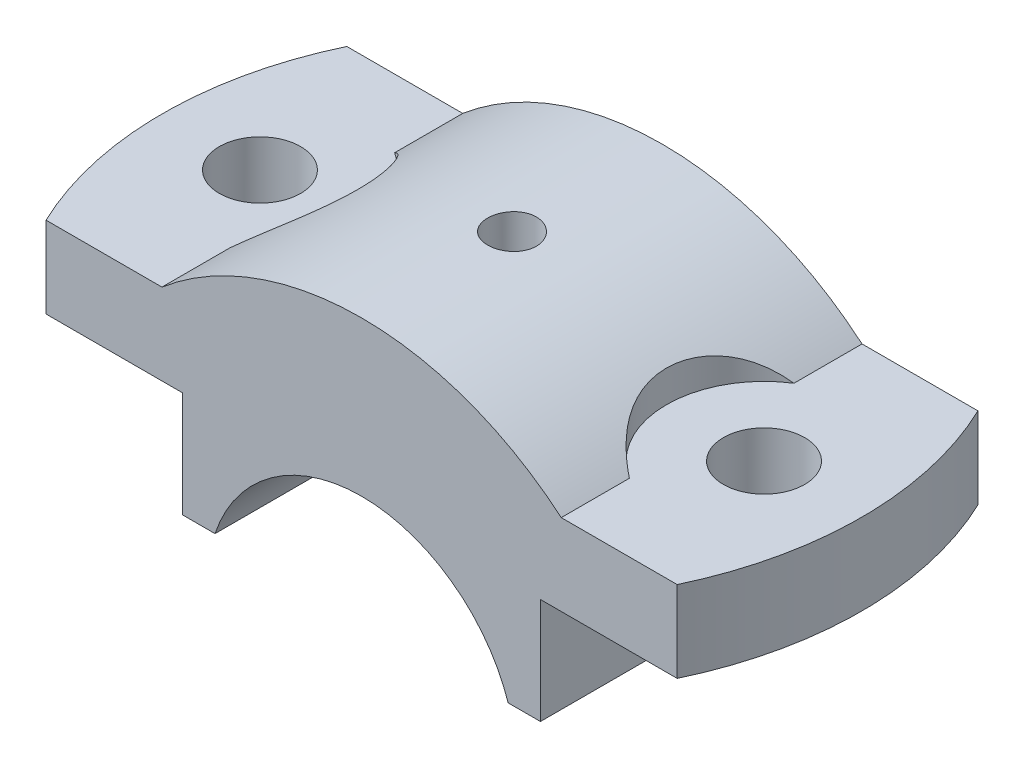
ISO-10303-21;
HEADER;
FILE_DESCRIPTION(('STEP AP214'),'2;1');
FILE_NAME('part.step','',(''),(''),'','','');
FILE_SCHEMA(('AUTOMOTIVE_DESIGN { 1 0 10303 214 1 1 1 1 }'));
ENDSEC;
DATA;
#1=APPLICATION_CONTEXT('core data for automotive mechanical design processes');
#2=APPLICATION_PROTOCOL_DEFINITION('international standard','automotive_design',2000,#1);
#3=PRODUCT_CONTEXT('',#1,'mechanical');
#4=PRODUCT('Part','Part','',(#3));
#5=PRODUCT_RELATED_PRODUCT_CATEGORY('part','',(#4));
#6=PRODUCT_DEFINITION_FORMATION('','',#4);
#7=PRODUCT_DEFINITION_CONTEXT('part definition',#1,'design');
#8=PRODUCT_DEFINITION('design','',#6,#7);
#9=PRODUCT_DEFINITION_SHAPE('','',#8);
#10=(LENGTH_UNIT() NAMED_UNIT(*) SI_UNIT(.MILLI.,.METRE.));
#11=(NAMED_UNIT(*) PLANE_ANGLE_UNIT() SI_UNIT($,.RADIAN.));
#12=(NAMED_UNIT(*) SI_UNIT($,.STERADIAN.) SOLID_ANGLE_UNIT());
#13=UNCERTAINTY_MEASURE_WITH_UNIT(LENGTH_MEASURE(1.E-05),#10,'distance_accuracy_value','');
#14=(GEOMETRIC_REPRESENTATION_CONTEXT(3) GLOBAL_UNCERTAINTY_ASSIGNED_CONTEXT((#13)) GLOBAL_UNIT_ASSIGNED_CONTEXT((#10,
#11,#12)) REPRESENTATION_CONTEXT('',''));
#15=CARTESIAN_POINT('',(0.,0.,0.));
#16=DIRECTION('',(0.,0.,1.));
#17=DIRECTION('',(1.,0.,0.));
#18=AXIS2_PLACEMENT_3D('',#15,#16,#17);
#19=CARTESIAN_POINT('',(0.,0.,18.5));
#20=DIRECTION('',(0.,0.,-1.));
#21=DIRECTION('',(-1.,0.,0.));
#22=AXIS2_PLACEMENT_3D('',#19,#20,#21);
#23=CYLINDRICAL_SURFACE('',#22,38.);
#24=CARTESIAN_POINT('',(0.,38.,3.));
#25=CARTESIAN_POINT('',(-0.168230277437707,37.9999984430739,2.99999263868346));
#26=CARTESIAN_POINT('',(-0.336575845655096,37.9988709200709,2.98580169916932));
#27=CARTESIAN_POINT('',(-0.668611397196743,37.9944814128081,2.92939894930334));
#28=CARTESIAN_POINT('',(-0.83229585009201,37.9912169949171,2.88715518982944));
#29=CARTESIAN_POINT('',(-1.15015205512758,37.9829226863334,2.77587406357067));
#30=CARTESIAN_POINT('',(-1.30432904935511,37.9778937789402,2.70685161752221));
#31=CARTESIAN_POINT('',(-1.59887136159142,37.9666348413683,2.54399853963547));
#32=CARTESIAN_POINT('',(-1.73923967362019,37.9604050724332,2.45017330191646));
#33=CARTESIAN_POINT('',(-2.00254103126273,37.9474277075509,2.24014409327319));
#34=CARTESIAN_POINT('',(-2.12543792166293,37.9406790810774,2.1238948563935));
#35=CARTESIAN_POINT('',(-2.3499978098834,37.9274332919605,1.87241281605956));
#36=CARTESIAN_POINT('',(-2.45165988585508,37.9209361402441,1.73717918887838));
#37=CARTESIAN_POINT('',(-2.63098484586303,37.9089176287414,1.45135065682847));
#38=CARTESIAN_POINT('',(-2.70861625469701,37.903397552738,1.30073594623714));
#39=CARTESIAN_POINT('',(-2.83747510230932,37.8939696224707,0.988558849059875));
#40=CARTESIAN_POINT('',(-2.8887029645124,37.8900617423529,0.82699663808231));
#41=CARTESIAN_POINT('',(-2.96319644645853,37.8843090780475,0.497870679819641));
#42=CARTESIAN_POINT('',(-2.98652059882487,37.8824599758018,0.330320257357769));
#43=CARTESIAN_POINT('',(-3.00472536931326,37.8810204867557,-0.00632681714998152));
#44=CARTESIAN_POINT('',(-2.99960647157769,37.8814300615093,-0.175423442828304));
#45=CARTESIAN_POINT('',(-2.96111886260012,37.8844577346025,-0.509962310035284));
#46=CARTESIAN_POINT('',(-2.92781369865024,37.8870708648728,-0.675411913710738));
#47=CARTESIAN_POINT('',(-2.83399765916123,37.8942034046858,-0.998365215123266));
#48=CARTESIAN_POINT('',(-2.77348654183749,37.8987228311701,-1.15586884222906));
#49=CARTESIAN_POINT('',(-2.62690490032728,37.9091644380148,-1.45866214971911));
#50=CARTESIAN_POINT('',(-2.5408057912968,37.9150881856644,-1.60393793599879));
#51=CARTESIAN_POINT('',(-2.34551283184453,37.9276694800349,-1.87799978791044));
#52=CARTESIAN_POINT('',(-2.23631856235737,37.9343270400699,-2.0067855542603));
#53=CARTESIAN_POINT('',(-1.99757813910437,37.947647885739,-2.24458115896057));
#54=CARTESIAN_POINT('',(-1.86797703439473,37.9543111370687,-2.35353583758634));
#55=CARTESIAN_POINT('',(-1.59229376436977,37.9668751419437,-2.54815019879117));
#56=CARTESIAN_POINT('',(-1.44621158946689,37.9727758950454,-2.63380986781872));
#57=CARTESIAN_POINT('',(-1.14167761997914,37.983150993084,-2.77939892547026));
#58=CARTESIAN_POINT('',(-0.98322469233549,37.9876252071703,-2.83932595392176));
#59=CARTESIAN_POINT('',(-0.658463212690179,37.9946415451888,-2.93171041942903));
#60=CARTESIAN_POINT('',(-0.492154807064348,37.997183705107,-2.96416836811963));
#61=CARTESIAN_POINT('',(-0.156881478742686,38.0000448768352,-3.00062434440681));
#62=CARTESIAN_POINT('',(0.0120751089608367,38.0003698415183,-3.00469857910483));
#63=CARTESIAN_POINT('',(0.348269003373998,37.9987758913175,-2.98447098943403));
#64=CARTESIAN_POINT('',(0.515506324442483,37.9968569951891,-2.96016940224689));
#65=CARTESIAN_POINT('',(0.843297753735754,37.9909950041868,-2.88394314979588));
#66=CARTESIAN_POINT('',(1.00386010671882,37.987054491835,-2.83205372367032));
#67=CARTESIAN_POINT('',(1.31399900365979,37.9775920824189,-2.70216068710783));
#68=CARTESIAN_POINT('',(1.46357539119334,37.972070162843,-2.62415670492505));
#69=CARTESIAN_POINT('',(1.74784375041781,37.9600494395666,-2.4440567104013));
#70=CARTESIAN_POINT('',(1.88250358772923,37.953548595394,-2.34191011569746));
#71=CARTESIAN_POINT('',(2.13279217984117,37.9403075453845,-2.1164976605111));
#72=CARTESIAN_POINT('',(2.24842063776819,37.9335673358158,-1.99323147064188));
#73=CARTESIAN_POINT('',(2.45762484975141,37.9205896766453,-1.72874864835166));
#74=CARTESIAN_POINT('',(2.55115094155128,37.9143533795852,-1.5874926690468));
#75=CARTESIAN_POINT('',(2.71315523827201,37.9031055627809,-1.29123629441747));
#76=CARTESIAN_POINT('',(2.78163367119924,37.8980940318878,-1.13623602422189));
#77=CARTESIAN_POINT('',(2.89151387110069,37.8898693720601,-0.817068099787169));
#78=CARTESIAN_POINT('',(2.93294623887225,37.8866542112497,-0.652911034998947));
#79=CARTESIAN_POINT('',(2.98765790023767,37.8823793491511,-0.319943850373173));
#80=CARTESIAN_POINT('',(3.00093767292138,37.8813196111828,-0.151133809767669));
#81=CARTESIAN_POINT('',(2.99896188688676,37.8814760426207,0.185853858942923));
#82=CARTESIAN_POINT('',(2.98378436644712,37.8826859878913,0.3540319530016));
#83=CARTESIAN_POINT('',(2.92548733876923,37.887232237977,0.685442873019112));
#84=CARTESIAN_POINT('',(2.8823677867555,37.8905685461995,0.84867569105299));
#85=CARTESIAN_POINT('',(2.76943001015431,37.8989899804525,1.16556899687011));
#86=CARTESIAN_POINT('',(2.69961296444522,37.9040750292632,1.31922990697071));
#87=CARTESIAN_POINT('',(2.535271096382,37.9154210711218,1.61266178094887));
#88=CARTESIAN_POINT('',(2.44074672054795,37.9216820429175,1.75243299578316));
#89=CARTESIAN_POINT('',(2.2293806238227,37.9346948182221,2.014516802884));
#90=CARTESIAN_POINT('',(2.11248130954252,37.941447859921,2.13678288515433));
#91=CARTESIAN_POINT('',(1.85978424897896,37.954672635902,2.36000556130417));
#92=CARTESIAN_POINT('',(1.72398192526551,37.9611443015481,2.46095697881558));
#93=CARTESIAN_POINT('',(1.43709756450133,37.9730876131211,2.63880542567551));
#94=CARTESIAN_POINT('',(1.2859897583193,37.978557527474,2.71566096437294));
#95=CARTESIAN_POINT('',(0.973076064569828,37.9878601967286,2.84281200189951));
#96=CARTESIAN_POINT('',(0.811282773093929,37.9916948408735,2.89313816633252));
#97=CARTESIAN_POINT('',(0.540438770546246,37.9963056825779,2.95292296572034));
#98=CARTESIAN_POINT('',(0.43313209821729,37.9976847801056,2.97055353917028));
#99=CARTESIAN_POINT('',(0.217232975456251,37.9995324404705,2.99409441950641));
#100=CARTESIAN_POINT('',(0.108640528034263,38.0000010054389,3.0000047538251));
#101=CARTESIAN_POINT('',(0.,38.,3.));
#102=B_SPLINE_CURVE_WITH_KNOTS('',3,(#24,#25,#26,#27,#28,#29,#30,#31,#32,#33,#34,#35,#36,#37,
#38,#39,#40,#41,#42,#43,#44,#45,#46,#47,#48,#49,#50,#51,#52,#53,#54,#55,#56,#57,#58,#59,#60,#61,
#62,#63,#64,#65,#66,#67,#68,#69,#70,#71,#72,#73,#74,#75,#76,#77,#78,#79,#80,#81,#82,#83,#84,#85,
#86,#87,#88,#89,#90,#91,#92,#93,#94,#95,#96,#97,#98,#99,#100,#101),.UNSPECIFIED.,.T.,.F.,(4,2,2,
2,2,2,2,2,2,2,2,2,2,2,2,2,2,2,2,2,2,2,2,2,2,2,2,2,2,2,2,2,2,2,2,2,2,2,4),(0.,0.504294188546742,
1.00916370078727,1.51375230936014,2.01823126998903,2.5237394549149,3.0292695804704,
3.53545907123703,4.04164044416133,4.54675814609822,5.05186725021796,5.55584058602809,
6.05981840083594,6.56436134901273,7.06891345298729,7.57484819748389,8.08078323629981,
8.5867646690735,9.09273667730813,9.59734968185782,10.1019584685879,10.6059242398503,
11.1098971854695,11.614935538604,12.1199817691652,12.6261522324058,13.1323180879118,
13.6379102536977,14.1434938154447,14.6476929456065,15.1518928837201,15.6560705605014,
16.1602391262259,16.6657233184336,17.1713301290485,17.6778028214878,18.183688785524,
18.5093549854357,18.8350204230892),.UNSPECIFIED.);
#103=CARTESIAN_POINT('',(0.,38.,3.));
#104=VERTEX_POINT('',#103);
#105=EDGE_CURVE('E12',#104,#104,#102,.T.);
#106=ORIENTED_EDGE('',*,*,#105,.T.);
#107=EDGE_LOOP('',(#106));
#108=FACE_BOUND('',#107,.T.);
#109=CARTESIAN_POINT('',(-24.5560583156174,29.,10.1230240327817));
#110=CARTESIAN_POINT('',(-24.3174877485478,29.2020601308055,9.97119467321229));
#111=CARTESIAN_POINT('',(-24.0803614609093,29.3977464472566,9.80836197663199));
#112=CARTESIAN_POINT('',(-23.6115222338329,29.7755940747945,9.46020848333533));
#113=CARTESIAN_POINT('',(-23.3798137585639,29.9577444842871,9.27486987046865));
#114=CARTESIAN_POINT('',(-22.9236672054079,30.3082297817881,8.8805505950972));
#115=CARTESIAN_POINT('',(-22.6992678834907,30.4764965902736,8.67146414758177));
#116=CARTESIAN_POINT('',(-22.2619530588752,30.7973853777589,8.23060697580725));
#117=CARTESIAN_POINT('',(-22.0490345989108,30.9500113947584,7.99884213681137));
#118=CARTESIAN_POINT('',(-21.6366389073685,31.2397139014292,7.51197498371822));
#119=CARTESIAN_POINT('',(-21.4372383074072,31.3767043342369,7.25675627382115));
#120=CARTESIAN_POINT('',(-21.0562467019345,31.633641893745,6.72522759534227));
#121=CARTESIAN_POINT('',(-20.8746574661728,31.7535873273726,6.44891553575109));
#122=CARTESIAN_POINT('',(-20.5327564022873,31.9757314891997,5.87769783144448));
#123=CARTESIAN_POINT('',(-20.3723929409772,32.0779734764171,5.58283998067528));
#124=CARTESIAN_POINT('',(-20.0751813729038,32.2648095853997,4.97618208833444));
#125=CARTESIAN_POINT('',(-19.938330146147,32.349406048985,4.66438430187312));
#126=CARTESIAN_POINT('',(-19.7031571958431,32.4931162623317,4.0590392734102));
#127=CARTESIAN_POINT('',(-19.6023304372824,32.5539481974974,3.76686941254452));
#128=CARTESIAN_POINT('',(-19.4229982355688,32.661262620038,3.17319380129246));
#129=CARTESIAN_POINT('',(-19.3444914281107,32.707745984483,2.87168862277639));
#130=CARTESIAN_POINT('',(-19.2108996671468,32.7863897663112,2.26156700473532));
#131=CARTESIAN_POINT('',(-19.1558244632389,32.8185442218776,1.95294766128773));
#132=CARTESIAN_POINT('',(-19.0699386598041,32.8685247770595,1.33120533745258));
#133=CARTESIAN_POINT('',(-19.0391272676089,32.8863513447496,1.01808250452872));
#134=CARTESIAN_POINT('',(-19.0033366089455,32.9070445700549,0.4090928211564));
#135=CARTESIAN_POINT('',(-18.9968952852205,32.9107579979134,0.11333938485734));
#136=CARTESIAN_POINT('',(-19.0058709098437,32.9055755487409,-0.477715169239618));
#137=CARTESIAN_POINT('',(-19.0212867536059,32.8966803089086,-0.773016309140038));
#138=CARTESIAN_POINT('',(-19.0737722856435,32.8662764129345,-1.36094659306719));
#139=CARTESIAN_POINT('',(-19.1108359102242,32.8447712889028,-1.65357646203284));
#140=CARTESIAN_POINT('',(-19.2061408416427,32.7891322412202,-2.23414907205153));
#141=CARTESIAN_POINT('',(-19.264382276703,32.7549982411068,-2.52209178471482));
#142=CARTESIAN_POINT('',(-19.4006764422116,32.6744541101646,-3.08865883197287));
#143=CARTESIAN_POINT('',(-19.4785435602166,32.6281588318639,-3.3673442180909));
#144=CARTESIAN_POINT('',(-19.6533719646105,32.5231511116921,-3.91624778286281));
#145=CARTESIAN_POINT('',(-19.7503330082788,32.4644388276644,-4.18646606909926));
#146=CARTESIAN_POINT('',(-19.9621218133717,32.3346424316118,-4.71664181119178));
#147=CARTESIAN_POINT('',(-20.0769448179247,32.2635616128922,-4.97660197587736));
#148=CARTESIAN_POINT('',(-20.323071538153,32.1090931283231,-5.48478925963508));
#149=CARTESIAN_POINT('',(-20.4543754358737,32.0257053265308,-5.73301624906259));
#150=CARTESIAN_POINT('',(-20.7357486540301,31.8442696037435,-6.22311708829393));
#151=CARTESIAN_POINT('',(-20.8862381186548,31.7458786272729,-6.46462258241658));
#152=CARTESIAN_POINT('',(-21.201110037337,31.5364658710071,-6.93262700625431));
#153=CARTESIAN_POINT('',(-21.3654931809921,31.4254434641697,-7.15912519010133));
#154=CARTESIAN_POINT('',(-21.7063737161354,31.1909623888811,-7.59640859494742));
#155=CARTESIAN_POINT('',(-21.8828828178434,31.0674916435289,-7.80717820501587));
#156=CARTESIAN_POINT('',(-22.2458177672454,30.8086571106979,-8.2120807419208));
#157=CARTESIAN_POINT('',(-22.4322425263686,30.6732946276711,-8.40621548889796));
#158=CARTESIAN_POINT('',(-22.9298954071164,30.3045469407131,-8.89141200340238));
#159=CARTESIAN_POINT('',(-23.2476114084472,30.0619152228811,-9.16898926094683));
#160=CARTESIAN_POINT('',(-23.7330937930094,29.6779862071021,-9.55167567534778));
#161=CARTESIAN_POINT('',(-23.896151828646,29.5468936289064,-9.67346515471955));
#162=CARTESIAN_POINT('',(-24.2245693700738,29.2782386813056,-9.90625956208693));
#163=CARTESIAN_POINT('',(-24.3899285039598,29.140677349028,-10.0172662101907));
#164=CARTESIAN_POINT('',(-24.5560583156173,29.,-10.1230240327817));
#165=B_SPLINE_CURVE_WITH_KNOTS('',3,(#109,#110,#111,#112,#113,#114,#115,#116,#117,#118,#119,
#120,#121,#122,#123,#124,#125,#126,#127,#128,#129,#130,#131,#132,#133,#134,#135,#136,#137,#138,
#139,#140,#141,#142,#143,#144,#145,#146,#147,#148,#149,#150,#151,#152,#153,#154,#155,#156,#157,
#158,#159,#160,#161,#162,#163,#164),.UNSPECIFIED.,.F.,.F.,(4,2,2,2,2,2,2,2,2,2,2,2,2,2,2,2,2,2,
2,2,2,2,2,2,2,2,2,4),(0.,1.04260461579409,2.08604002646036,3.1343206028679,4.18232985812432,
5.23585430274667,6.28948332048404,7.3405002657876,8.39137763682358,9.33518162511063,
10.2789279110469,11.2230664949041,12.1671742336547,13.0536509025234,13.9400827735082,
14.8262664677281,15.7124555274994,16.590558754706,17.4686508202461,18.346509437567,
19.2243777524391,20.1266463918458,21.028959840704,21.9321572606495,22.8352557287013,
24.2916394519587,25.0176312708732,25.7435070866397),.UNSPECIFIED.);
#166=CARTESIAN_POINT('',(-24.5560583156174,29.,10.1230240327817));
#167=VERTEX_POINT('',#166);
#168=CARTESIAN_POINT('',(-24.5560583156174,29.,-10.1230240327817));
#169=VERTEX_POINT('',#168);
#170=EDGE_CURVE('E54',#167,#169,#165,.T.);
#171=ORIENTED_EDGE('',*,*,#170,.F.);
#172=DIRECTION('',(0.,0.,-1.));
#173=VECTOR('',#172,1.);
#174=CARTESIAN_POINT('',(-24.5560583156174,29.,18.5));
#175=LINE('',#174,#173);
#176=CARTESIAN_POINT('',(-24.5560583156174,29.,18.5));
#177=VERTEX_POINT('',#176);
#178=EDGE_CURVE('E169',#177,#167,#175,.T.);
#179=ORIENTED_EDGE('',*,*,#178,.F.);
#180=CARTESIAN_POINT('',(0.,0.,18.5));
#181=DIRECTION('',(0.,0.,1.));
#182=DIRECTION('',(1.,0.,0.));
#183=AXIS2_PLACEMENT_3D('',#180,#181,#182);
#184=CIRCLE('',#183,38.);
#185=CARTESIAN_POINT('',(24.5560583156174,29.,18.5));
#186=VERTEX_POINT('',#185);
#187=EDGE_CURVE('E349',#186,#177,#184,.T.);
#188=ORIENTED_EDGE('',*,*,#187,.F.);
#189=DIRECTION('',(0.,0.,-1.));
#190=VECTOR('',#189,1.);
#191=CARTESIAN_POINT('',(24.5560583156174,29.,18.5));
#192=LINE('',#191,#190);
#193=CARTESIAN_POINT('',(24.5560583156174,29.,10.1230240327817));
#194=VERTEX_POINT('',#193);
#195=EDGE_CURVE('E159',#186,#194,#192,.T.);
#196=ORIENTED_EDGE('',*,*,#195,.T.);
#197=CARTESIAN_POINT('',(24.5560583156174,29.,-10.1230240327817));
#198=CARTESIAN_POINT('',(24.3174877485478,29.2020601308055,-9.97119467321229));
#199=CARTESIAN_POINT('',(24.0803614609093,29.3977464472566,-9.80836197663199));
#200=CARTESIAN_POINT('',(23.6115222338329,29.7755940747945,-9.46020848333533));
#201=CARTESIAN_POINT('',(23.3798137585639,29.9577444842871,-9.27486987046865));
#202=CARTESIAN_POINT('',(22.9236672054079,30.3082297817881,-8.8805505950972));
#203=CARTESIAN_POINT('',(22.6992678834907,30.4764965902736,-8.67146414758177));
#204=CARTESIAN_POINT('',(22.2619530588752,30.7973853777589,-8.23060697580725));
#205=CARTESIAN_POINT('',(22.0490345989108,30.9500113947584,-7.99884213681137));
#206=CARTESIAN_POINT('',(21.6366389073685,31.2397139014292,-7.51197498371822));
#207=CARTESIAN_POINT('',(21.4372383074072,31.3767043342369,-7.25675627382115));
#208=CARTESIAN_POINT('',(21.0562467019345,31.633641893745,-6.72522759534227));
#209=CARTESIAN_POINT('',(20.8746574661728,31.7535873273726,-6.44891553575109));
#210=CARTESIAN_POINT('',(20.5327564022873,31.9757314891997,-5.87769783144448));
#211=CARTESIAN_POINT('',(20.3723929409772,32.0779734764171,-5.58283998067528));
#212=CARTESIAN_POINT('',(20.0751813729038,32.2648095853997,-4.97618208833444));
#213=CARTESIAN_POINT('',(19.938330146147,32.349406048985,-4.66438430187312));
#214=CARTESIAN_POINT('',(19.7031571958431,32.4931162623317,-4.0590392734102));
#215=CARTESIAN_POINT('',(19.6023304372824,32.5539481974974,-3.76686941254452));
#216=CARTESIAN_POINT('',(19.4229982355688,32.661262620038,-3.17319380129246));
#217=CARTESIAN_POINT('',(19.3444914281107,32.707745984483,-2.87168862277639));
#218=CARTESIAN_POINT('',(19.2108996671468,32.7863897663112,-2.26156700473532));
#219=CARTESIAN_POINT('',(19.1558244632389,32.8185442218776,-1.95294766128773));
#220=CARTESIAN_POINT('',(19.0699386598041,32.8685247770595,-1.33120533745258));
#221=CARTESIAN_POINT('',(19.0391272676089,32.8863513447496,-1.01808250452872));
#222=CARTESIAN_POINT('',(19.0033366089455,32.9070445700549,-0.4090928211564));
#223=CARTESIAN_POINT('',(18.9968952852205,32.9107579979134,-0.11333938485734));
#224=CARTESIAN_POINT('',(19.0058709098437,32.9055755487409,0.477715169239618));
#225=CARTESIAN_POINT('',(19.0212867536059,32.8966803089086,0.773016309140038));
#226=CARTESIAN_POINT('',(19.0737722856435,32.8662764129345,1.36094659306719));
#227=CARTESIAN_POINT('',(19.1108359102242,32.8447712889028,1.65357646203284));
#228=CARTESIAN_POINT('',(19.2061408416427,32.7891322412202,2.23414907205153));
#229=CARTESIAN_POINT('',(19.264382276703,32.7549982411068,2.52209178471482));
#230=CARTESIAN_POINT('',(19.4006764422116,32.6744541101646,3.08865883197287));
#231=CARTESIAN_POINT('',(19.4785435602166,32.6281588318639,3.3673442180909));
#232=CARTESIAN_POINT('',(19.6533719646105,32.5231511116921,3.91624778286281));
#233=CARTESIAN_POINT('',(19.7503330082788,32.4644388276644,4.18646606909926));
#234=CARTESIAN_POINT('',(19.9621218133717,32.3346424316118,4.71664181119178));
#235=CARTESIAN_POINT('',(20.0769448179247,32.2635616128922,4.97660197587736));
#236=CARTESIAN_POINT('',(20.323071538153,32.1090931283231,5.48478925963508));
#237=CARTESIAN_POINT('',(20.4543754358737,32.0257053265308,5.73301624906259));
#238=CARTESIAN_POINT('',(20.7357486540301,31.8442696037435,6.22311708829393));
#239=CARTESIAN_POINT('',(20.8862381186548,31.7458786272729,6.46462258241658));
#240=CARTESIAN_POINT('',(21.201110037337,31.5364658710071,6.93262700625431));
#241=CARTESIAN_POINT('',(21.3654931809921,31.4254434641697,7.15912519010133));
#242=CARTESIAN_POINT('',(21.7063737161354,31.1909623888811,7.59640859494742));
#243=CARTESIAN_POINT('',(21.8828828178434,31.0674916435289,7.80717820501587));
#244=CARTESIAN_POINT('',(22.2458177672454,30.8086571106979,8.2120807419208));
#245=CARTESIAN_POINT('',(22.4322425263686,30.6732946276711,8.40621548889796));
#246=CARTESIAN_POINT('',(22.9298954071164,30.3045469407131,8.89141200340238));
#247=CARTESIAN_POINT('',(23.2476114084472,30.0619152228811,9.16898926094683));
#248=CARTESIAN_POINT('',(23.7330937930094,29.6779862071021,9.55167567534778));
#249=CARTESIAN_POINT('',(23.896151828646,29.5468936289064,9.67346515471955));
#250=CARTESIAN_POINT('',(24.2245693700738,29.2782386813056,9.90625956208693));
#251=CARTESIAN_POINT('',(24.3899285039598,29.140677349028,10.0172662101907));
#252=CARTESIAN_POINT('',(24.5560583156173,29.,10.1230240327817));
#253=B_SPLINE_CURVE_WITH_KNOTS('',3,(#197,#198,#199,#200,#201,#202,#203,#204,#205,#206,#207,
#208,#209,#210,#211,#212,#213,#214,#215,#216,#217,#218,#219,#220,#221,#222,#223,#224,#225,#226,
#227,#228,#229,#230,#231,#232,#233,#234,#235,#236,#237,#238,#239,#240,#241,#242,#243,#244,#245,
#246,#247,#248,#249,#250,#251,#252),.UNSPECIFIED.,.F.,.F.,(4,2,2,2,2,2,2,2,2,2,2,2,2,2,2,2,2,2,
2,2,2,2,2,2,2,2,2,4),(0.,1.04260461579409,2.08604002646036,3.1343206028679,4.18232985812432,
5.23585430274667,6.28948332048404,7.3405002657876,8.39137763682358,9.33518162511063,
10.2789279110469,11.2230664949041,12.1671742336547,13.0536509025234,13.9400827735082,
14.8262664677281,15.7124555274994,16.590558754706,17.4686508202461,18.346509437567,
19.2243777524391,20.1266463918458,21.028959840704,21.9321572606495,22.8352557287013,
24.2916394519587,25.0176312708732,25.7435070866397),.UNSPECIFIED.);
#254=CARTESIAN_POINT('',(24.5560583156174,29.,-10.1230240327817));
#255=VERTEX_POINT('',#254);
#256=EDGE_CURVE('E148',#255,#194,#253,.T.);
#257=ORIENTED_EDGE('',*,*,#256,.F.);
#258=CARTESIAN_POINT('',(24.5560583156174,29.,-18.5));
#259=VERTEX_POINT('',#258);
#260=EDGE_CURVE('E156',#255,#259,#192,.T.);
#261=ORIENTED_EDGE('',*,*,#260,.T.);
#262=CARTESIAN_POINT('',(0.,0.,-18.5));
#263=DIRECTION('',(0.,0.,1.));
#264=DIRECTION('',(1.,0.,0.));
#265=AXIS2_PLACEMENT_3D('',#262,#263,#264);
#266=CIRCLE('',#265,38.);
#267=CARTESIAN_POINT('',(-24.5560583156174,29.,-18.5));
#268=VERTEX_POINT('',#267);
#269=EDGE_CURVE('E381',#259,#268,#266,.T.);
#270=ORIENTED_EDGE('',*,*,#269,.T.);
#271=EDGE_CURVE('E174',#169,#268,#175,.T.);
#272=ORIENTED_EDGE('',*,*,#271,.F.);
#273=EDGE_LOOP('',(#171,#179,#188,#196,#257,#261,#270,#272));
#274=FACE_BOUND('',#273,.T.);
#275=ADVANCED_FACE('F40',(#108,#274),#23,.T.);
#276=CARTESIAN_POINT('',(22.,19.,18.5));
#277=DIRECTION('',(0.,1.,0.));
#278=DIRECTION('',(-1.,0.,0.));
#279=AXIS2_PLACEMENT_3D('',#276,#277,#278);
#280=PLANE('',#279);
#281=CARTESIAN_POINT('',(31.,19.,0.));
#282=DIRECTION('',(0.,1.,0.));
#283=DIRECTION('',(-1.,0.,0.));
#284=AXIS2_PLACEMENT_3D('',#281,#282,#283);
#285=CIRCLE('',#284,5.);
#286=CARTESIAN_POINT('',(26.,19.,0.));
#287=VERTEX_POINT('',#286);
#288=EDGE_CURVE('E199',#287,#287,#285,.T.);
#289=ORIENTED_EDGE('',*,*,#288,.T.);
#290=EDGE_LOOP('',(#289));
#291=FACE_BOUND('',#290,.T.);
#292=CARTESIAN_POINT('',(0.,19.,0.));
#293=DIRECTION('',(0.,1.,0.));
#294=DIRECTION('',(-1.,0.,0.));
#295=AXIS2_PLACEMENT_3D('',#292,#293,#294);
#296=CIRCLE('',#295,43.);
#297=CARTESIAN_POINT('',(38.816877772433,19.,18.5));
#298=VERTEX_POINT('',#297);
#299=CARTESIAN_POINT('',(38.816877772433,19.,-18.5));
#300=VERTEX_POINT('',#299);
#301=EDGE_CURVE('E317',#298,#300,#296,.T.);
#302=ORIENTED_EDGE('',*,*,#301,.F.);
#303=DIRECTION('',(1.,0.,0.));
#304=VECTOR('',#303,1.);
#305=CARTESIAN_POINT('',(22.,19.,18.5));
#306=LINE('',#305,#304);
#307=CARTESIAN_POINT('',(22.,19.,18.5));
#308=VERTEX_POINT('',#307);
#309=EDGE_CURVE('E342',#308,#298,#306,.T.);
#310=ORIENTED_EDGE('',*,*,#309,.F.);
#311=DIRECTION('',(0.,0.,-1.));
#312=VECTOR('',#311,1.);
#313=CARTESIAN_POINT('',(22.,19.,18.5));
#314=LINE('',#313,#312);
#315=CARTESIAN_POINT('',(22.,19.,-18.5));
#316=VERTEX_POINT('',#315);
#317=EDGE_CURVE('E173',#308,#316,#314,.T.);
#318=ORIENTED_EDGE('',*,*,#317,.T.);
#319=DIRECTION('',(1.,0.,0.));
#320=VECTOR('',#319,1.);
#321=CARTESIAN_POINT('',(22.,19.,-18.5));
#322=LINE('',#321,#320);
#323=EDGE_CURVE('E375',#316,#300,#322,.T.);
#324=ORIENTED_EDGE('',*,*,#323,.T.);
#325=EDGE_LOOP('',(#302,#310,#318,#324));
#326=FACE_BOUND('',#325,.T.);
#327=ADVANCED_FACE('F257',(#291,#326),#280,.F.);
#328=CARTESIAN_POINT('',(43.,29.,18.5));
#329=DIRECTION('',(0.,-1.,0.));
#330=DIRECTION('',(0.,0.,-1.));
#331=AXIS2_PLACEMENT_3D('',#328,#329,#330);
#332=PLANE('',#331);
#333=ORIENTED_EDGE('',*,*,#260,.F.);
#334=CARTESIAN_POINT('',(31.,29.,0.));
#335=DIRECTION('',(0.,1.,0.));
#336=DIRECTION('',(0.,0.,1.));
#337=AXIS2_PLACEMENT_3D('',#334,#335,#336);
#338=CIRCLE('',#337,12.);
#339=EDGE_CURVE('E61',#255,#194,#338,.T.);
#340=ORIENTED_EDGE('',*,*,#339,.T.);
#341=ORIENTED_EDGE('',*,*,#195,.F.);
#342=DIRECTION('',(-1.,0.,0.));
#343=VECTOR('',#342,1.);
#344=CARTESIAN_POINT('',(43.,29.,18.5));
#345=LINE('',#344,#343);
#346=CARTESIAN_POINT('',(38.816877772433,29.,18.5));
#347=VERTEX_POINT('',#346);
#348=EDGE_CURVE('E346',#347,#186,#345,.T.);
#349=ORIENTED_EDGE('',*,*,#348,.F.);
#350=CARTESIAN_POINT('',(0.,29.,0.));
#351=DIRECTION('',(0.,1.,0.));
#352=DIRECTION('',(0.,0.,1.));
#353=AXIS2_PLACEMENT_3D('',#350,#351,#352);
#354=CIRCLE('',#353,43.);
#355=CARTESIAN_POINT('',(38.816877772433,29.,-18.5));
#356=VERTEX_POINT('',#355);
#357=EDGE_CURVE('E314',#347,#356,#354,.T.);
#358=ORIENTED_EDGE('',*,*,#357,.T.);
#359=DIRECTION('',(-1.,0.,0.));
#360=VECTOR('',#359,1.);
#361=CARTESIAN_POINT('',(43.,29.,-18.5));
#362=LINE('',#361,#360);
#363=EDGE_CURVE('E166',#356,#259,#362,.T.);
#364=ORIENTED_EDGE('',*,*,#363,.T.);
#365=EDGE_LOOP('',(#333,#340,#341,#349,#358,#364));
#366=FACE_BOUND('',#365,.T.);
#367=CARTESIAN_POINT('',(31.,29.,0.));
#368=DIRECTION('',(0.,1.,0.));
#369=DIRECTION('',(0.,0.,-1.));
#370=AXIS2_PLACEMENT_3D('',#367,#368,#369);
#371=CIRCLE('',#370,5.);
#372=CARTESIAN_POINT('',(31.,29.,-5.));
#373=VERTEX_POINT('',#372);
#374=EDGE_CURVE('E302',#373,#373,#371,.T.);
#375=ORIENTED_EDGE('',*,*,#374,.F.);
#376=EDGE_LOOP('',(#375));
#377=FACE_BOUND('',#376,.T.);
#378=ADVANCED_FACE('F163',(#366,#377),#332,.F.);
#379=CARTESIAN_POINT('',(-43.,29.,18.5));
#380=DIRECTION('',(0.,-1.,0.));
#381=DIRECTION('',(0.,0.,-1.));
#382=AXIS2_PLACEMENT_3D('',#379,#380,#381);
#383=PLANE('',#382);
#384=CARTESIAN_POINT('',(-38.816877772433,29.,-18.5));
#385=VERTEX_POINT('',#384);
#386=CARTESIAN_POINT('',(-38.816877772433,29.,18.5));
#387=VERTEX_POINT('',#386);
#388=EDGE_CURVE('E313',#385,#387,#354,.T.);
#389=ORIENTED_EDGE('',*,*,#388,.T.);
#390=DIRECTION('',(-1.,0.,0.));
#391=VECTOR('',#390,1.);
#392=CARTESIAN_POINT('',(-43.,29.,18.5));
#393=LINE('',#392,#391);
#394=EDGE_CURVE('E352',#177,#387,#393,.T.);
#395=ORIENTED_EDGE('',*,*,#394,.F.);
#396=ORIENTED_EDGE('',*,*,#178,.T.);
#397=CARTESIAN_POINT('',(-31.,29.,0.));
#398=DIRECTION('',(0.,1.,0.));
#399=DIRECTION('',(0.,0.,1.));
#400=AXIS2_PLACEMENT_3D('',#397,#398,#399);
#401=CIRCLE('',#400,12.);
#402=EDGE_CURVE('E69',#167,#169,#401,.T.);
#403=ORIENTED_EDGE('',*,*,#402,.T.);
#404=ORIENTED_EDGE('',*,*,#271,.T.);
#405=DIRECTION('',(-1.,0.,0.));
#406=VECTOR('',#405,1.);
#407=CARTESIAN_POINT('',(-43.,29.,-18.5));
#408=LINE('',#407,#406);
#409=EDGE_CURVE('E384',#268,#385,#408,.T.);
#410=ORIENTED_EDGE('',*,*,#409,.T.);
#411=EDGE_LOOP('',(#389,#395,#396,#403,#404,#410));
#412=FACE_BOUND('',#411,.T.);
#413=CARTESIAN_POINT('',(-31.,29.,0.));
#414=DIRECTION('',(0.,1.,0.));
#415=DIRECTION('',(0.,0.,1.));
#416=AXIS2_PLACEMENT_3D('',#413,#414,#415);
#417=CIRCLE('',#416,5.);
#418=CARTESIAN_POINT('',(-31.,29.,5.));
#419=VERTEX_POINT('',#418);
#420=EDGE_CURVE('E200',#419,#419,#417,.T.);
#421=ORIENTED_EDGE('',*,*,#420,.F.);
#422=EDGE_LOOP('',(#421));
#423=FACE_BOUND('',#422,.T.);
#424=ADVANCED_FACE('F251',(#412,#423),#383,.F.);
#425=CARTESIAN_POINT('',(-22.,19.,18.5));
#426=DIRECTION('',(0.,1.,0.));
#427=DIRECTION('',(-1.,0.,0.));
#428=AXIS2_PLACEMENT_3D('',#425,#426,#427);
#429=PLANE('',#428);
#430=CARTESIAN_POINT('',(-31.,19.,0.));
#431=DIRECTION('',(0.,1.,0.));
#432=DIRECTION('',(-1.,0.,0.));
#433=AXIS2_PLACEMENT_3D('',#430,#431,#432);
#434=CIRCLE('',#433,5.);
#435=CARTESIAN_POINT('',(-36.,19.,0.));
#436=VERTEX_POINT('',#435);
#437=EDGE_CURVE('E196',#436,#436,#434,.T.);
#438=ORIENTED_EDGE('',*,*,#437,.T.);
#439=EDGE_LOOP('',(#438));
#440=FACE_BOUND('',#439,.T.);
#441=CARTESIAN_POINT('',(0.,19.,0.));
#442=DIRECTION('',(0.,1.,0.));
#443=DIRECTION('',(-1.,0.,0.));
#444=AXIS2_PLACEMENT_3D('',#441,#442,#443);
#445=CIRCLE('',#444,43.);
#446=CARTESIAN_POINT('',(-38.816877772433,19.,-18.5));
#447=VERTEX_POINT('',#446);
#448=CARTESIAN_POINT('',(-38.816877772433,19.,18.5));
#449=VERTEX_POINT('',#448);
#450=EDGE_CURVE('E323',#447,#449,#445,.T.);
#451=ORIENTED_EDGE('',*,*,#450,.F.);
#452=DIRECTION('',(1.,0.,0.));
#453=VECTOR('',#452,1.);
#454=CARTESIAN_POINT('',(-22.,19.,-18.5));
#455=LINE('',#454,#453);
#456=CARTESIAN_POINT('',(-22.,19.,-18.5));
#457=VERTEX_POINT('',#456);
#458=EDGE_CURVE('E388',#447,#457,#455,.T.);
#459=ORIENTED_EDGE('',*,*,#458,.T.);
#460=DIRECTION('',(0.,0.,-1.));
#461=VECTOR('',#460,1.);
#462=CARTESIAN_POINT('',(-22.,19.,18.5));
#463=LINE('',#462,#461);
#464=CARTESIAN_POINT('',(-22.,19.,18.5));
#465=VERTEX_POINT('',#464);
#466=EDGE_CURVE('E402',#465,#457,#463,.T.);
#467=ORIENTED_EDGE('',*,*,#466,.F.);
#468=DIRECTION('',(1.,0.,0.));
#469=VECTOR('',#468,1.);
#470=CARTESIAN_POINT('',(-22.,19.,18.5));
#471=LINE('',#470,#469);
#472=EDGE_CURVE('E356',#449,#465,#471,.T.);
#473=ORIENTED_EDGE('',*,*,#472,.F.);
#474=EDGE_LOOP('',(#451,#459,#467,#473));
#475=FACE_BOUND('',#474,.T.);
#476=ADVANCED_FACE('F237',(#440,#475),#429,.F.);
#477=CARTESIAN_POINT('',(0.,0.,18.5));
#478=DIRECTION('',(0.,0.,-1.));
#479=DIRECTION('',(-1.,0.,0.));
#480=AXIS2_PLACEMENT_3D('',#477,#478,#479);
#481=PLANE('',#480);
#482=DIRECTION('',(0.,1.,0.));
#483=VECTOR('',#482,1.);
#484=CARTESIAN_POINT('',(-38.816877772433,6.,18.5));
#485=LINE('',#484,#483);
#486=EDGE_CURVE('E326',#449,#387,#485,.T.);
#487=ORIENTED_EDGE('',*,*,#486,.F.);
#488=ORIENTED_EDGE('',*,*,#472,.T.);
#489=DIRECTION('',(0.,-1.,0.));
#490=VECTOR('',#489,1.);
#491=CARTESIAN_POINT('',(-22.,6.,18.5));
#492=LINE('',#491,#490);
#493=CARTESIAN_POINT('',(-22.,6.,18.5));
#494=VERTEX_POINT('',#493);
#495=EDGE_CURVE('E359',#465,#494,#492,.T.);
#496=ORIENTED_EDGE('',*,*,#495,.T.);
#497=DIRECTION('',(1.,0.,0.));
#498=VECTOR('',#497,1.);
#499=CARTESIAN_POINT('',(-18.0277563773199,6.,18.5));
#500=LINE('',#499,#498);
#501=CARTESIAN_POINT('',(-18.0277563773199,6.,18.5));
#502=VERTEX_POINT('',#501);
#503=EDGE_CURVE('E362',#494,#502,#500,.T.);
#504=ORIENTED_EDGE('',*,*,#503,.T.);
#505=CARTESIAN_POINT('',(0.,0.,18.5));
#506=DIRECTION('',(0.,0.,-1.));
#507=DIRECTION('',(-1.,0.,0.));
#508=AXIS2_PLACEMENT_3D('',#505,#506,#507);
#509=CIRCLE('',#508,19.);
#510=CARTESIAN_POINT('',(18.0277563773199,6.,18.5));
#511=VERTEX_POINT('',#510);
#512=EDGE_CURVE('E331',#502,#511,#509,.T.);
#513=ORIENTED_EDGE('',*,*,#512,.T.);
#514=DIRECTION('',(1.,0.,0.));
#515=VECTOR('',#514,1.);
#516=CARTESIAN_POINT('',(18.0277563773199,6.,18.5));
#517=LINE('',#516,#515);
#518=CARTESIAN_POINT('',(22.,6.,18.5));
#519=VERTEX_POINT('',#518);
#520=EDGE_CURVE('E335',#511,#519,#517,.T.);
#521=ORIENTED_EDGE('',*,*,#520,.T.);
#522=DIRECTION('',(0.,1.,0.));
#523=VECTOR('',#522,1.);
#524=CARTESIAN_POINT('',(22.,6.,18.5));
#525=LINE('',#524,#523);
#526=EDGE_CURVE('E339',#519,#308,#525,.T.);
#527=ORIENTED_EDGE('',*,*,#526,.T.);
#528=ORIENTED_EDGE('',*,*,#309,.T.);
#529=DIRECTION('',(0.,1.,0.));
#530=VECTOR('',#529,1.);
#531=CARTESIAN_POINT('',(38.816877772433,6.,18.5));
#532=LINE('',#531,#530);
#533=EDGE_CURVE('E320',#347,#298,#532,.F.);
#534=ORIENTED_EDGE('',*,*,#533,.F.);
#535=ORIENTED_EDGE('',*,*,#348,.T.);
#536=ORIENTED_EDGE('',*,*,#187,.T.);
#537=ORIENTED_EDGE('',*,*,#394,.T.);
#538=EDGE_LOOP('',(#487,#488,#496,#504,#513,#521,#527,#528,#534,#535,#536,#537));
#539=FACE_BOUND('',#538,.T.);
#540=ADVANCED_FACE('F233',(#539),#481,.F.);
#541=CARTESIAN_POINT('',(0.,0.,-18.5));
#542=DIRECTION('',(0.,0.,-1.));
#543=DIRECTION('',(-1.,0.,0.));
#544=AXIS2_PLACEMENT_3D('',#541,#542,#543);
#545=PLANE('',#544);
#546=ORIENTED_EDGE('',*,*,#458,.F.);
#547=DIRECTION('',(0.,1.,0.));
#548=VECTOR('',#547,1.);
#549=CARTESIAN_POINT('',(-38.816877772433,6.,-18.5));
#550=LINE('',#549,#548);
#551=EDGE_CURVE('E161',#447,#385,#550,.T.);
#552=ORIENTED_EDGE('',*,*,#551,.T.);
#553=ORIENTED_EDGE('',*,*,#409,.F.);
#554=ORIENTED_EDGE('',*,*,#269,.F.);
#555=ORIENTED_EDGE('',*,*,#363,.F.);
#556=DIRECTION('',(0.,1.,0.));
#557=VECTOR('',#556,1.);
#558=CARTESIAN_POINT('',(38.816877772433,6.,-18.5));
#559=LINE('',#558,#557);
#560=EDGE_CURVE('E189',#356,#300,#559,.F.);
#561=ORIENTED_EDGE('',*,*,#560,.T.);
#562=ORIENTED_EDGE('',*,*,#323,.F.);
#563=DIRECTION('',(0.,1.,0.));
#564=VECTOR('',#563,1.);
#565=CARTESIAN_POINT('',(22.,6.,-18.5));
#566=LINE('',#565,#564);
#567=CARTESIAN_POINT('',(22.,6.,-18.5));
#568=VERTEX_POINT('',#567);
#569=EDGE_CURVE('E372',#568,#316,#566,.T.);
#570=ORIENTED_EDGE('',*,*,#569,.F.);
#571=DIRECTION('',(1.,0.,0.));
#572=VECTOR('',#571,1.);
#573=CARTESIAN_POINT('',(18.0277563773199,6.,-18.5));
#574=LINE('',#573,#572);
#575=CARTESIAN_POINT('',(18.0277563773199,6.,-18.5));
#576=VERTEX_POINT('',#575);
#577=EDGE_CURVE('E369',#576,#568,#574,.T.);
#578=ORIENTED_EDGE('',*,*,#577,.F.);
#579=CARTESIAN_POINT('',(0.,0.,-18.5));
#580=DIRECTION('',(0.,0.,-1.));
#581=DIRECTION('',(-1.,0.,0.));
#582=AXIS2_PLACEMENT_3D('',#579,#580,#581);
#583=CIRCLE('',#582,19.);
#584=CARTESIAN_POINT('',(-18.0277563773199,6.,-18.5));
#585=VERTEX_POINT('',#584);
#586=EDGE_CURVE('E330',#585,#576,#583,.T.);
#587=ORIENTED_EDGE('',*,*,#586,.F.);
#588=DIRECTION('',(1.,0.,0.));
#589=VECTOR('',#588,1.);
#590=CARTESIAN_POINT('',(-18.0277563773199,6.,-18.5));
#591=LINE('',#590,#589);
#592=CARTESIAN_POINT('',(-22.,6.,-18.5));
#593=VERTEX_POINT('',#592);
#594=EDGE_CURVE('E336',#593,#585,#591,.T.);
#595=ORIENTED_EDGE('',*,*,#594,.F.);
#596=DIRECTION('',(0.,-1.,0.));
#597=VECTOR('',#596,1.);
#598=CARTESIAN_POINT('',(-22.,6.,-18.5));
#599=LINE('',#598,#597);
#600=EDGE_CURVE('E391',#457,#593,#599,.T.);
#601=ORIENTED_EDGE('',*,*,#600,.F.);
#602=EDGE_LOOP('',(#546,#552,#553,#554,#555,#561,#562,#570,#578,#587,#595,#601));
#603=FACE_BOUND('',#602,.T.);
#604=ADVANCED_FACE('F236',(#603),#545,.T.);
#605=CARTESIAN_POINT('',(0.,0.,18.5));
#606=DIRECTION('',(0.,0.,-1.));
#607=DIRECTION('',(-1.,0.,0.));
#608=AXIS2_PLACEMENT_3D('',#605,#606,#607);
#609=CYLINDRICAL_SURFACE('',#608,19.);
#610=CARTESIAN_POINT('',(0.,19.,2.));
#611=CARTESIAN_POINT('',(-0.11200841784424,18.9999986504858,1.99999516573833));
#612=CARTESIAN_POINT('',(-0.224090111161561,18.9989990230296,1.99055889680671));
#613=CARTESIAN_POINT('',(-0.445143942835667,18.9951074391116,1.95305947014799));
#614=CARTESIAN_POINT('',(-0.554112554348489,18.9922134187954,1.92497599666464));
#615=CARTESIAN_POINT('',(-0.765707302443462,18.9848596062168,1.8510107030298));
#616=CARTESIAN_POINT('',(-0.868337309177083,18.9804007807146,1.80513987034518));
#617=CARTESIAN_POINT('',(-1.06441973305317,18.9704154188168,1.69692383769803));
#618=CARTESIAN_POINT('',(-1.15787392189217,18.9648890891521,1.63458182665772));
#619=CARTESIAN_POINT('',(-1.33334438873615,18.9533628684286,1.49492795596601));
#620=CARTESIAN_POINT('',(-1.41531912695826,18.9473613745813,1.41756403026598));
#621=CARTESIAN_POINT('',(-1.565146544656,18.9355744197151,1.25017365931094));
#622=CARTESIAN_POINT('',(-1.63299855874326,18.9297889688855,1.16014661777132));
#623=CARTESIAN_POINT('',(-1.75280323659791,18.9190729200505,0.969723394577345));
#624=CARTESIAN_POINT('',(-1.80471802529949,18.914144370344,0.869303258684454));
#625=CARTESIAN_POINT('',(-1.89093273887728,18.9057203232874,0.661110224426025));
#626=CARTESIAN_POINT('',(-1.92523314323209,18.9022247869301,0.553337526293989));
#627=CARTESIAN_POINT('',(-1.97512160268772,18.8970772279925,0.333924009162994));
#628=CARTESIAN_POINT('',(-1.99077883849768,18.89541839144,0.22229908247124));
#629=CARTESIAN_POINT('',(-2.0031504028124,18.8941109684303,-0.00200560674562178));
#630=CARTESIAN_POINT('',(-1.99986527971529,18.8944623237764,-0.114685338638889));
#631=CARTESIAN_POINT('',(-1.97450235287994,18.8971293595455,-0.337423187696995));
#632=CARTESIAN_POINT('',(-1.9525002124111,18.8994371310552,-0.447490028600793));
#633=CARTESIAN_POINT('',(-1.89044560340129,18.9057446232425,-0.662360167032263));
#634=CARTESIAN_POINT('',(-1.85039286737173,18.9097443689933,-0.767163386533676));
#635=CARTESIAN_POINT('',(-1.75329092276144,18.9189942182592,-0.968769558840193));
#636=CARTESIAN_POINT('',(-1.69620827788725,18.924246777425,-1.06555629008193));
#637=CARTESIAN_POINT('',(-1.5666908868141,18.9354083854364,-1.24820451022723));
#638=CARTESIAN_POINT('',(-1.49425564251871,18.9413174555787,-1.33406564451841));
#639=CARTESIAN_POINT('',(-1.33566725362225,18.9531615143885,-1.49286496945571));
#640=CARTESIAN_POINT('',(-1.24944878844049,18.9590964885675,-1.56573794327334));
#641=CARTESIAN_POINT('',(-1.06596783254353,18.9702964129385,-1.69598642755748));
#642=CARTESIAN_POINT('',(-0.968705327324304,18.9755613622506,-1.75336191767097));
#643=CARTESIAN_POINT('',(-0.765851049247982,18.9848300236665,-1.85098464956963));
#644=CARTESIAN_POINT('',(-0.660257600030996,18.9888334811183,-1.89122843362495));
#645=CARTESIAN_POINT('',(-0.443760807693445,18.9951255457873,-1.95339682190644));
#646=CARTESIAN_POINT('',(-0.33285764070319,18.9974142098446,-1.97532203333918));
#647=CARTESIAN_POINT('',(-0.10945415486235,19.0000115000819,-2.0001478206134));
#648=CARTESIAN_POINT('',(0.00303606230926623,19.0003294893725,-2.0031383607282));
#649=CARTESIAN_POINT('',(0.226916078948062,18.9989747412679,-1.99024642072478));
#650=CARTESIAN_POINT('',(0.338305894892619,18.9973020337271,-1.97436422363963));
#651=CARTESIAN_POINT('',(0.55656238434741,18.9921598049335,-1.92425230355234));
#652=CARTESIAN_POINT('',(0.663438869422735,18.9886944241164,-1.89006485280642));
#653=CARTESIAN_POINT('',(0.869940226842277,18.9803554527278,-1.8043564208408));
#654=CARTESIAN_POINT('',(0.969564920006208,18.9754818273755,-1.75283501150315));
#655=CARTESIAN_POINT('',(1.1591405212946,18.9648478148886,-1.63369910407212));
#656=CARTESIAN_POINT('',(1.2490542105761,18.9590842083916,-1.56602567335374));
#657=CARTESIAN_POINT('',(1.4162783677793,18.9473268886042,-1.41659100446358));
#658=CARTESIAN_POINT('',(1.49358848438461,18.9413331689054,-1.334829373723));
#659=CARTESIAN_POINT('',(1.63372463331255,18.9297628392476,-1.15914593885537));
#660=CARTESIAN_POINT('',(1.69649150588153,18.9241879932099,-1.06517681254066));
#661=CARTESIAN_POINT('',(1.80535237129506,18.9141138909103,-0.867978499351848));
#662=CARTESIAN_POINT('',(1.85144661326567,18.9096146185771,-0.764749450870261));
#663=CARTESIAN_POINT('',(1.9255553544566,18.9022123156369,-0.552162157692862));
#664=CARTESIAN_POINT('',(1.95360469740686,18.8993062103248,-0.442816171180851));
#665=CARTESIAN_POINT('',(1.99094032598198,18.8954098830964,-0.220934202465845));
#666=CARTESIAN_POINT('',(2.0002272132674,18.8944195997449,-0.108398322671341));
#667=CARTESIAN_POINT('',(1.99976544627054,18.8944684327453,0.116080860562154));
#668=CARTESIAN_POINT('',(1.99010972282517,18.8954976416447,0.228024368875611));
#669=CARTESIAN_POINT('',(1.95223204844791,18.8994483350085,0.448689276972299));
#670=CARTESIAN_POINT('',(1.92401007974408,18.9023698212842,0.557410673671163));
#671=CARTESIAN_POINT('',(1.8498273564277,18.9097730829315,0.768542193330042));
#672=CARTESIAN_POINT('',(1.80386967534044,18.914254587945,0.870953406254667));
#673=CARTESIAN_POINT('',(1.69552954133722,18.92427346405,1.0666237205497));
#674=CARTESIAN_POINT('',(1.63314712244591,18.9298108329541,1.15988284087858));
#675=CARTESIAN_POINT('',(1.49337993384352,18.9413500753827,1.33507784961183));
#676=CARTESIAN_POINT('',(1.41592586926296,18.9473540143885,1.41695832174561));
#677=CARTESIAN_POINT('',(1.24835332858252,18.9591311345796,1.56659934584307));
#678=CARTESIAN_POINT('',(1.15823183336865,18.9649042603311,1.63435652211979));
#679=CARTESIAN_POINT('',(0.967607481740735,18.975586079652,1.75397748265883));
#680=CARTESIAN_POINT('',(0.867076685429857,18.9804923457825,1.80579692805057));
#681=CARTESIAN_POINT('',(0.658751573856579,18.9888617207062,1.8917493082323));
#682=CARTESIAN_POINT('',(0.550965545177142,18.9923264445262,1.92590204635311));
#683=CARTESIAN_POINT('',(0.368815809489715,18.9965585235102,1.96710051782824));
#684=CARTESIAN_POINT('',(0.29561370936933,18.9978430079455,1.97942080130333));
#685=CARTESIAN_POINT('',(0.148285110063316,18.9995641909453,1.99587212351454));
#686=CARTESIAN_POINT('',(0.0741586152162605,19.0000008934873,2.0000032006715));
#687=CARTESIAN_POINT('',(0.,19.,2.));
#688=B_SPLINE_CURVE_WITH_KNOTS('',3,(#610,#611,#612,#613,#614,#615,#616,#617,#618,#619,#620,
#621,#622,#623,#624,#625,#626,#627,#628,#629,#630,#631,#632,#633,#634,#635,#636,#637,#638,#639,
#640,#641,#642,#643,#644,#645,#646,#647,#648,#649,#650,#651,#652,#653,#654,#655,#656,#657,#658,
#659,#660,#661,#662,#663,#664,#665,#666,#667,#668,#669,#670,#671,#672,#673,#674,#675,#676,#677,
#678,#679,#680,#681,#682,#683,#684,#685,#686,#687),.UNSPECIFIED.,.T.,.F.,(4,2,2,2,2,2,2,2,2,2,2,
2,2,2,2,2,2,2,2,2,2,2,2,2,2,2,2,2,2,2,2,2,2,2,2,2,2,2,4),(0.,0.335754439352711,
0.671875277970158,1.00778882057924,1.34363737584089,1.68067146079848,2.01772142143432,
2.35556629403224,2.69340196971664,3.02998006509479,3.36654841628654,3.7017626251813,
4.03698180171968,4.37286352370219,4.70875614462734,5.0462905608226,5.38382542030326,
5.72142837292331,6.05902013455861,6.39500668575047,6.73098819823996,7.06619715516561,
7.40141439176389,7.73787392755746,8.07434284033891,8.41215732699426,8.74996676574403,
9.08712193908635,9.42426630061443,9.75976079635823,10.0952556132439,10.4306923163605,
10.7661283246087,11.103144648226,11.4402414318415,11.7782677107181,12.1159142565989,
12.3382118443412,12.5605083891396),.UNSPECIFIED.);
#689=CARTESIAN_POINT('',(0.,19.,2.));
#690=VERTEX_POINT('',#689);
#691=EDGE_CURVE('E289',#690,#690,#688,.T.);
#692=ORIENTED_EDGE('',*,*,#691,.F.);
#693=EDGE_LOOP('',(#692));
#694=FACE_BOUND('',#693,.T.);
#695=ORIENTED_EDGE('',*,*,#586,.T.);
#696=DIRECTION('',(0.,0.,-1.));
#697=VECTOR('',#696,1.);
#698=CARTESIAN_POINT('',(18.0277563773199,6.,18.5));
#699=LINE('',#698,#697);
#700=EDGE_CURVE('E185',#511,#576,#699,.T.);
#701=ORIENTED_EDGE('',*,*,#700,.F.);
#702=ORIENTED_EDGE('',*,*,#512,.F.);
#703=DIRECTION('',(0.,0.,-1.));
#704=VECTOR('',#703,1.);
#705=CARTESIAN_POINT('',(-18.0277563773199,6.,18.5));
#706=LINE('',#705,#704);
#707=EDGE_CURVE('E365',#502,#585,#706,.T.);
#708=ORIENTED_EDGE('',*,*,#707,.T.);
#709=EDGE_LOOP('',(#695,#701,#702,#708));
#710=FACE_BOUND('',#709,.T.);
#711=ADVANCED_FACE('F42',(#694,#710),#609,.F.);
#712=CARTESIAN_POINT('',(18.0277563773199,6.,18.5));
#713=DIRECTION('',(0.,1.,0.));
#714=DIRECTION('',(-1.,0.,0.));
#715=AXIS2_PLACEMENT_3D('',#712,#713,#714);
#716=PLANE('',#715);
#717=ORIENTED_EDGE('',*,*,#577,.T.);
#718=DIRECTION('',(0.,0.,-1.));
#719=VECTOR('',#718,1.);
#720=CARTESIAN_POINT('',(22.,6.,18.5));
#721=LINE('',#720,#719);
#722=EDGE_CURVE('E181',#519,#568,#721,.T.);
#723=ORIENTED_EDGE('',*,*,#722,.F.);
#724=ORIENTED_EDGE('',*,*,#520,.F.);
#725=ORIENTED_EDGE('',*,*,#700,.T.);
#726=EDGE_LOOP('',(#717,#723,#724,#725));
#727=FACE_BOUND('',#726,.T.);
#728=ADVANCED_FACE('F426',(#727),#716,.F.);
#729=CARTESIAN_POINT('',(22.,6.,18.5));
#730=DIRECTION('',(-1.,0.,0.));
#731=DIRECTION('',(0.,0.,1.));
#732=AXIS2_PLACEMENT_3D('',#729,#730,#731);
#733=PLANE('',#732);
#734=ORIENTED_EDGE('',*,*,#569,.T.);
#735=ORIENTED_EDGE('',*,*,#317,.F.);
#736=ORIENTED_EDGE('',*,*,#526,.F.);
#737=ORIENTED_EDGE('',*,*,#722,.T.);
#738=EDGE_LOOP('',(#734,#735,#736,#737));
#739=FACE_BOUND('',#738,.T.);
#740=ADVANCED_FACE('F248',(#739),#733,.F.);
#741=CARTESIAN_POINT('',(-22.,6.,18.5));
#742=DIRECTION('',(1.,0.,0.));
#743=DIRECTION('',(0.,0.,-1.));
#744=AXIS2_PLACEMENT_3D('',#741,#742,#743);
#745=PLANE('',#744);
#746=ORIENTED_EDGE('',*,*,#600,.T.);
#747=DIRECTION('',(0.,0.,-1.));
#748=VECTOR('',#747,1.);
#749=CARTESIAN_POINT('',(-22.,6.,18.5));
#750=LINE('',#749,#748);
#751=EDGE_CURVE('E399',#494,#593,#750,.T.);
#752=ORIENTED_EDGE('',*,*,#751,.F.);
#753=ORIENTED_EDGE('',*,*,#495,.F.);
#754=ORIENTED_EDGE('',*,*,#466,.T.);
#755=EDGE_LOOP('',(#746,#752,#753,#754));
#756=FACE_BOUND('',#755,.T.);
#757=ADVANCED_FACE('F244',(#756),#745,.F.);
#758=CARTESIAN_POINT('',(-18.0277563773199,6.,18.5));
#759=DIRECTION('',(0.,1.,0.));
#760=DIRECTION('',(-1.,0.,0.));
#761=AXIS2_PLACEMENT_3D('',#758,#759,#760);
#762=PLANE('',#761);
#763=ORIENTED_EDGE('',*,*,#594,.T.);
#764=ORIENTED_EDGE('',*,*,#707,.F.);
#765=ORIENTED_EDGE('',*,*,#503,.F.);
#766=ORIENTED_EDGE('',*,*,#751,.T.);
#767=EDGE_LOOP('',(#763,#764,#765,#766));
#768=FACE_BOUND('',#767,.T.);
#769=ADVANCED_FACE('F231',(#768),#762,.F.);
#770=CARTESIAN_POINT('',(0.,6.,0.));
#771=DIRECTION('',(0.,1.,0.));
#772=DIRECTION('',(0.,0.,1.));
#773=AXIS2_PLACEMENT_3D('',#770,#771,#772);
#774=CYLINDRICAL_SURFACE('',#773,43.);
#775=ORIENTED_EDGE('',*,*,#301,.T.);
#776=ORIENTED_EDGE('',*,*,#560,.F.);
#777=ORIENTED_EDGE('',*,*,#357,.F.);
#778=ORIENTED_EDGE('',*,*,#533,.T.);
#779=EDGE_LOOP('',(#775,#776,#777,#778));
#780=FACE_BOUND('',#779,.T.);
#781=ADVANCED_FACE('F228',(#780),#774,.T.);
#782=ORIENTED_EDGE('',*,*,#551,.F.);
#783=ORIENTED_EDGE('',*,*,#450,.T.);
#784=ORIENTED_EDGE('',*,*,#486,.T.);
#785=ORIENTED_EDGE('',*,*,#388,.F.);
#786=EDGE_LOOP('',(#782,#783,#784,#785));
#787=FACE_BOUND('',#786,.T.);
#788=ADVANCED_FACE('F223',(#787),#774,.T.);
#789=CARTESIAN_POINT('',(-31.,6.,0.));
#790=DIRECTION('',(0.,1.,0.));
#791=DIRECTION('',(0.,0.,1.));
#792=AXIS2_PLACEMENT_3D('',#789,#790,#791);
#793=CYLINDRICAL_SURFACE('',#792,5.);
#794=ORIENTED_EDGE('',*,*,#420,.T.);
#795=EDGE_LOOP('',(#794));
#796=FACE_BOUND('',#795,.T.);
#797=ORIENTED_EDGE('',*,*,#437,.F.);
#798=EDGE_LOOP('',(#797));
#799=FACE_BOUND('',#798,.T.);
#800=ADVANCED_FACE('F220',(#796,#799),#793,.F.);
#801=CARTESIAN_POINT('',(31.,6.,0.));
#802=DIRECTION('',(0.,1.,0.));
#803=DIRECTION('',(0.,0.,1.));
#804=AXIS2_PLACEMENT_3D('',#801,#802,#803);
#805=CYLINDRICAL_SURFACE('',#804,5.);
#806=ORIENTED_EDGE('',*,*,#374,.T.);
#807=EDGE_LOOP('',(#806));
#808=FACE_BOUND('',#807,.T.);
#809=ORIENTED_EDGE('',*,*,#288,.F.);
#810=EDGE_LOOP('',(#809));
#811=FACE_BOUND('',#810,.T.);
#812=ADVANCED_FACE('F218',(#808,#811),#805,.F.);
#813=CARTESIAN_POINT('',(31.,66.,0.));
#814=DIRECTION('',(0.,-1.,0.));
#815=DIRECTION('',(0.,0.,-1.));
#816=AXIS2_PLACEMENT_3D('',#813,#814,#815);
#817=CYLINDRICAL_SURFACE('',#816,12.);
#818=ORIENTED_EDGE('',*,*,#256,.T.);
#819=ORIENTED_EDGE('',*,*,#339,.F.);
#820=EDGE_LOOP('',(#818,#819));
#821=FACE_BOUND('',#820,.T.);
#822=ADVANCED_FACE('F147',(#821),#817,.F.);
#823=CARTESIAN_POINT('',(-31.,66.,0.));
#824=DIRECTION('',(0.,-1.,0.));
#825=DIRECTION('',(0.,0.,-1.));
#826=AXIS2_PLACEMENT_3D('',#823,#824,#825);
#827=CYLINDRICAL_SURFACE('',#826,12.);
#828=ORIENTED_EDGE('',*,*,#170,.T.);
#829=ORIENTED_EDGE('',*,*,#402,.F.);
#830=EDGE_LOOP('',(#828,#829));
#831=FACE_BOUND('',#830,.T.);
#832=ADVANCED_FACE('F217',(#831),#827,.F.);
#833=CARTESIAN_POINT('',(0.,25.,0.));
#834=DIRECTION('',(0.,1.,0.));
#835=DIRECTION('',(0.,0.,1.));
#836=AXIS2_PLACEMENT_3D('',#833,#834,#835);
#837=CYLINDRICAL_SURFACE('',#836,3.);
#838=CARTESIAN_POINT('',(0.,25.,0.));
#839=DIRECTION('',(0.,1.,0.));
#840=DIRECTION('',(0.,0.,1.));
#841=AXIS2_PLACEMENT_3D('',#838,#839,#840);
#842=CIRCLE('',#841,3.);
#843=CARTESIAN_POINT('',(0.,25.,3.));
#844=VERTEX_POINT('',#843);
#845=EDGE_CURVE('E151',#844,#844,#842,.T.);
#846=ORIENTED_EDGE('',*,*,#845,.F.);
#847=EDGE_LOOP('',(#846));
#848=FACE_BOUND('',#847,.T.);
#849=ORIENTED_EDGE('',*,*,#105,.F.);
#850=EDGE_LOOP('',(#849));
#851=FACE_BOUND('',#850,.T.);
#852=ADVANCED_FACE('F268',(#848,#851),#837,.F.);
#853=CARTESIAN_POINT('',(0.,25.,0.));
#854=DIRECTION('',(0.,1.,0.));
#855=DIRECTION('',(0.,0.,1.));
#856=AXIS2_PLACEMENT_3D('',#853,#854,#855);
#857=PLANE('',#856);
#858=CARTESIAN_POINT('',(0.,25.,0.));
#859=DIRECTION('',(0.,1.,0.));
#860=DIRECTION('',(0.,0.,1.));
#861=AXIS2_PLACEMENT_3D('',#858,#859,#860);
#862=CIRCLE('',#861,2.);
#863=CARTESIAN_POINT('',(0.,25.,2.));
#864=VERTEX_POINT('',#863);
#865=EDGE_CURVE('E297',#864,#864,#862,.T.);
#866=ORIENTED_EDGE('',*,*,#865,.F.);
#867=EDGE_LOOP('',(#866));
#868=FACE_BOUND('',#867,.T.);
#869=ORIENTED_EDGE('',*,*,#845,.T.);
#870=EDGE_LOOP('',(#869));
#871=FACE_BOUND('',#870,.T.);
#872=ADVANCED_FACE('F270',(#868,#871),#857,.T.);
#873=CARTESIAN_POINT('',(0.,5.999,0.));
#874=DIRECTION('',(0.,1.,0.));
#875=DIRECTION('',(0.,0.,1.));
#876=AXIS2_PLACEMENT_3D('',#873,#874,#875);
#877=CYLINDRICAL_SURFACE('',#876,2.);
#878=ORIENTED_EDGE('',*,*,#865,.T.);
#879=EDGE_LOOP('',(#878));
#880=FACE_BOUND('',#879,.T.);
#881=ORIENTED_EDGE('',*,*,#691,.T.);
#882=EDGE_LOOP('',(#881));
#883=FACE_BOUND('',#882,.T.);
#884=ADVANCED_FACE('F276',(#880,#883),#877,.F.);
#885=CLOSED_SHELL('',(#275,#327,#378,#424,#476,#540,#604,#711,#728,#740,#757,#769,#781,#788,
#800,#812,#822,#832,#852,#872,#884));
#886=MANIFOLD_SOLID_BREP('B2',#885);
#887=ADVANCED_BREP_SHAPE_REPRESENTATION('',(#18,#886),#14);
#888=SHAPE_DEFINITION_REPRESENTATION(#9,#887);
ENDSEC;
END-ISO-10303-21;
